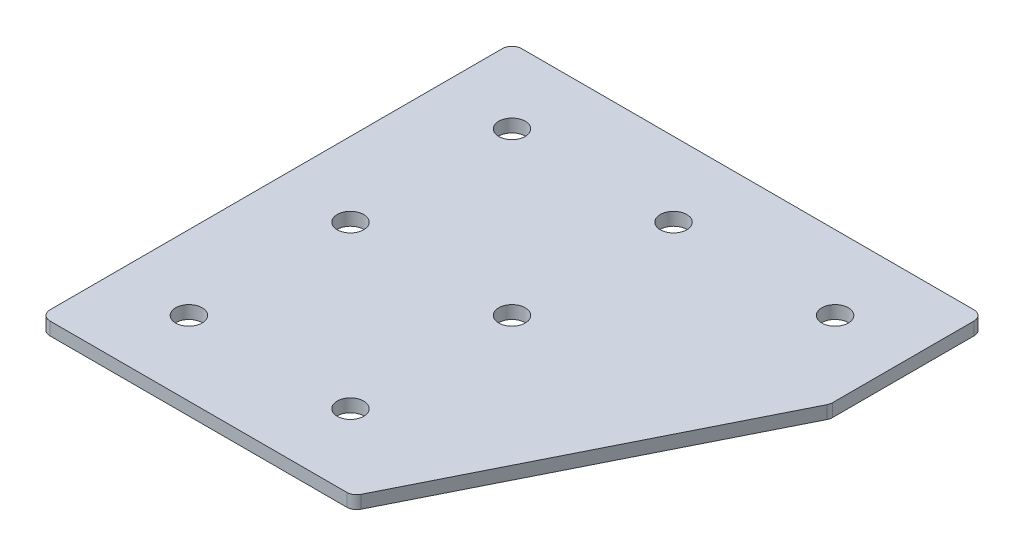
ISO-10303-21;
HEADER;
FILE_DESCRIPTION(('STEP AP214'),'2;1');
FILE_NAME('part.step','',(''),(''),'','','');
FILE_SCHEMA(('AUTOMOTIVE_DESIGN { 1 0 10303 214 1 1 1 1 }'));
ENDSEC;
DATA;
#1=APPLICATION_CONTEXT('core data for automotive mechanical design processes');
#2=APPLICATION_PROTOCOL_DEFINITION('international standard','automotive_design',2000,#1);
#3=PRODUCT_CONTEXT('',#1,'mechanical');
#4=PRODUCT('Part','Part','',(#3));
#5=PRODUCT_RELATED_PRODUCT_CATEGORY('part','',(#4));
#6=PRODUCT_DEFINITION_FORMATION('','',#4);
#7=PRODUCT_DEFINITION_CONTEXT('part definition',#1,'design');
#8=PRODUCT_DEFINITION('design','',#6,#7);
#9=PRODUCT_DEFINITION_SHAPE('','',#8);
#10=(LENGTH_UNIT() NAMED_UNIT(*) SI_UNIT(.MILLI.,.METRE.));
#11=(NAMED_UNIT(*) PLANE_ANGLE_UNIT() SI_UNIT($,.RADIAN.));
#12=(NAMED_UNIT(*) SI_UNIT($,.STERADIAN.) SOLID_ANGLE_UNIT());
#13=UNCERTAINTY_MEASURE_WITH_UNIT(LENGTH_MEASURE(1.E-05),#10,'distance_accuracy_value','');
#14=(GEOMETRIC_REPRESENTATION_CONTEXT(3) GLOBAL_UNCERTAINTY_ASSIGNED_CONTEXT((#13)) GLOBAL_UNIT_ASSIGNED_CONTEXT((#10,
#11,#12)) REPRESENTATION_CONTEXT('',''));
#15=CARTESIAN_POINT('',(0.,0.,0.));
#16=DIRECTION('',(0.,0.,1.));
#17=DIRECTION('',(1.,0.,0.));
#18=AXIS2_PLACEMENT_3D('',#15,#16,#17);
#19=CARTESIAN_POINT('',(-26.9370240083275,0.924626277263087,-50.9871269738255));
#20=DIRECTION('',(0.,-1.,0.));
#21=DIRECTION('',(0.,0.,-1.));
#22=AXIS2_PLACEMENT_3D('',#19,#20,#21);
#23=PLANE('',#22);
#24=CARTESIAN_POINT('',(-1.93702400832748,0.924626277263087,49.0128730261745));
#25=DIRECTION('',(0.,1.,0.));
#26=DIRECTION('',(0.,0.,1.));
#27=AXIS2_PLACEMENT_3D('',#24,#25,#26);
#28=CIRCLE('',#27,4.10000000000001);
#29=CARTESIAN_POINT('',(-1.93702400832748,0.924626277263087,53.1128730261745));
#30=VERTEX_POINT('',#29);
#31=EDGE_CURVE('E255',#30,#30,#28,.T.);
#32=ORIENTED_EDGE('',*,*,#31,.T.);
#33=EDGE_LOOP('',(#32));
#34=FACE_BOUND('',#33,.T.);
#35=CARTESIAN_POINT('',(-51.9370240083275,0.924626277263087,49.0128730261745));
#36=DIRECTION('',(0.,1.,0.));
#37=DIRECTION('',(0.,0.,1.));
#38=AXIS2_PLACEMENT_3D('',#35,#36,#37);
#39=CIRCLE('',#38,4.10000000000001);
#40=CARTESIAN_POINT('',(-51.9370240083275,0.924626277263087,53.1128730261745));
#41=VERTEX_POINT('',#40);
#42=EDGE_CURVE('E263',#41,#41,#39,.T.);
#43=ORIENTED_EDGE('',*,*,#42,.T.);
#44=EDGE_LOOP('',(#43));
#45=FACE_BOUND('',#44,.T.);
#46=CARTESIAN_POINT('',(-1.93702400832747,0.924626277263087,-0.987126973825483));
#47=DIRECTION('',(0.,1.,0.));
#48=DIRECTION('',(0.,0.,1.));
#49=AXIS2_PLACEMENT_3D('',#46,#47,#48);
#50=CIRCLE('',#49,4.1);
#51=CARTESIAN_POINT('',(-1.93702400832747,0.924626277263087,3.11287302617452));
#52=VERTEX_POINT('',#51);
#53=EDGE_CURVE('E269',#52,#52,#50,.T.);
#54=ORIENTED_EDGE('',*,*,#53,.T.);
#55=EDGE_LOOP('',(#54));
#56=FACE_BOUND('',#55,.T.);
#57=CARTESIAN_POINT('',(-51.9370240083275,0.924626277263087,-0.987126973825483));
#58=DIRECTION('',(0.,1.,0.));
#59=DIRECTION('',(0.,0.,1.));
#60=AXIS2_PLACEMENT_3D('',#57,#58,#59);
#61=CIRCLE('',#60,4.1);
#62=CARTESIAN_POINT('',(-51.9370240083275,0.924626277263087,3.11287302617452));
#63=VERTEX_POINT('',#62);
#64=EDGE_CURVE('E275',#63,#63,#61,.T.);
#65=ORIENTED_EDGE('',*,*,#64,.T.);
#66=EDGE_LOOP('',(#65));
#67=FACE_BOUND('',#66,.T.);
#68=CARTESIAN_POINT('',(48.0629759916725,0.924626277263087,-50.9871269738255));
#69=DIRECTION('',(0.,1.,0.));
#70=DIRECTION('',(0.,0.,1.));
#71=AXIS2_PLACEMENT_3D('',#68,#69,#70);
#72=CIRCLE('',#71,4.09999999999999);
#73=CARTESIAN_POINT('',(48.0629759916725,0.924626277263087,-46.8871269738255));
#74=VERTEX_POINT('',#73);
#75=EDGE_CURVE('E281',#74,#74,#72,.T.);
#76=ORIENTED_EDGE('',*,*,#75,.T.);
#77=EDGE_LOOP('',(#76));
#78=FACE_BOUND('',#77,.T.);
#79=CARTESIAN_POINT('',(-1.93702400832746,0.924626277263087,-50.9871269738255));
#80=DIRECTION('',(0.,1.,0.));
#81=DIRECTION('',(0.,0.,1.));
#82=AXIS2_PLACEMENT_3D('',#79,#80,#81);
#83=CIRCLE('',#82,4.1);
#84=CARTESIAN_POINT('',(-1.93702400832746,0.924626277263087,-46.8871269738255));
#85=VERTEX_POINT('',#84);
#86=EDGE_CURVE('E287',#85,#85,#83,.T.);
#87=ORIENTED_EDGE('',*,*,#86,.T.);
#88=EDGE_LOOP('',(#87));
#89=FACE_BOUND('',#88,.T.);
#90=CARTESIAN_POINT('',(-51.9370240083275,0.924626277263087,-50.9871269738255));
#91=DIRECTION('',(0.,1.,0.));
#92=DIRECTION('',(0.,0.,1.));
#93=AXIS2_PLACEMENT_3D('',#90,#91,#92);
#94=CIRCLE('',#93,4.1);
#95=CARTESIAN_POINT('',(-51.9370240083275,0.924626277263087,-46.8871269738255));
#96=VERTEX_POINT('',#95);
#97=EDGE_CURVE('E175',#96,#96,#94,.T.);
#98=ORIENTED_EDGE('',*,*,#97,.T.);
#99=EDGE_LOOP('',(#98));
#100=FACE_BOUND('',#99,.T.);
#101=DIRECTION('',(1.,0.,0.));
#102=VECTOR('',#101,1.);
#103=CARTESIAN_POINT('',(-74.9370240083276,0.924626277263087,72.0128730261745));
#104=LINE('',#103,#102);
#105=CARTESIAN_POINT('',(-71.9370240083276,0.924626277263087,72.0128730261745));
#106=VERTEX_POINT('',#105);
#107=CARTESIAN_POINT('',(19.9728060479232,0.924626277263087,72.0128730261745));
#108=VERTEX_POINT('',#107);
#109=EDGE_CURVE('E121',#106,#108,#104,.T.);
#110=ORIENTED_EDGE('',*,*,#109,.F.);
#111=CARTESIAN_POINT('',(-71.9370240083276,0.924626277263087,69.0128730261745));
#112=DIRECTION('',(0.,-1.,0.));
#113=DIRECTION('',(0.,0.,-1.));
#114=AXIS2_PLACEMENT_3D('',#111,#112,#113);
#115=CIRCLE('',#114,3.);
#116=CARTESIAN_POINT('',(-74.9370240083276,0.924626277263087,69.0128730261745));
#117=VERTEX_POINT('',#116);
#118=EDGE_CURVE('E145',#106,#117,#115,.T.);
#119=ORIENTED_EDGE('',*,*,#118,.T.);
#120=DIRECTION('',(0.,0.,1.));
#121=VECTOR('',#120,1.);
#122=CARTESIAN_POINT('',(-74.9370240083276,0.924626277263087,-73.9871269738255));
#123=LINE('',#122,#121);
#124=CARTESIAN_POINT('',(-74.9370240083276,0.924626277263087,-70.9871269738255));
#125=VERTEX_POINT('',#124);
#126=EDGE_CURVE('E162',#125,#117,#123,.T.);
#127=ORIENTED_EDGE('',*,*,#126,.F.);
#128=CARTESIAN_POINT('',(-71.9370240083276,0.924626277263087,-70.9871269738255));
#129=DIRECTION('',(0.,-1.,0.));
#130=DIRECTION('',(0.,0.,-1.));
#131=AXIS2_PLACEMENT_3D('',#128,#129,#130);
#132=CIRCLE('',#131,3.);
#133=CARTESIAN_POINT('',(-71.9370240083276,0.924626277263087,-73.9871269738255));
#134=VERTEX_POINT('',#133);
#135=EDGE_CURVE('E117',#125,#134,#132,.T.);
#136=ORIENTED_EDGE('',*,*,#135,.T.);
#137=DIRECTION('',(-1.,0.,0.));
#138=VECTOR('',#137,1.);
#139=CARTESIAN_POINT('',(71.0629759916724,0.924626277263087,-73.9871269738255));
#140=LINE('',#139,#138);
#141=CARTESIAN_POINT('',(68.0629759916724,0.924626277263087,-73.9871269738255));
#142=VERTEX_POINT('',#141);
#143=EDGE_CURVE('E160',#142,#134,#140,.T.);
#144=ORIENTED_EDGE('',*,*,#143,.F.);
#145=CARTESIAN_POINT('',(68.0629759916724,0.924626277263087,-70.9871269738255));
#146=DIRECTION('',(0.,-1.,0.));
#147=DIRECTION('',(0.,0.,-1.));
#148=AXIS2_PLACEMENT_3D('',#145,#146,#147);
#149=CIRCLE('',#148,3.);
#150=CARTESIAN_POINT('',(71.0629759916724,0.924626277263087,-70.9871269738255));
#151=VERTEX_POINT('',#150);
#152=EDGE_CURVE('E140',#142,#151,#149,.T.);
#153=ORIENTED_EDGE('',*,*,#152,.T.);
#154=DIRECTION('',(0.,0.,-1.));
#155=VECTOR('',#154,1.);
#156=CARTESIAN_POINT('',(71.0629759916724,0.924626277263087,-26.459262928825));
#157=LINE('',#156,#155);
#158=CARTESIAN_POINT('',(71.0629759916724,0.924626277263087,-27.1674668613244));
#159=VERTEX_POINT('',#158);
#160=EDGE_CURVE('E163',#159,#151,#157,.T.);
#161=ORIENTED_EDGE('',*,*,#160,.F.);
#162=CARTESIAN_POINT('',(68.0629759916724,0.924626277263087,-27.1674668613244));
#163=DIRECTION('',(0.,-1.,0.));
#164=DIRECTION('',(0.,0.,-1.));
#165=AXIS2_PLACEMENT_3D('',#162,#163,#164);
#166=CIRCLE('',#165,3.);
#167=CARTESIAN_POINT('',(70.7462575646721,0.924626277263087,-25.8258260748245));
#168=VERTEX_POINT('',#167);
#169=EDGE_CURVE('E31',#159,#168,#166,.T.);
#170=ORIENTED_EDGE('',*,*,#169,.T.);
#171=DIRECTION('',(0.447213595499956,0.,-0.894427190999917));
#172=VECTOR('',#171,1.);
#173=CARTESIAN_POINT('',(21.8269080141728,0.924626277263087,72.0128730261745));
#174=LINE('',#173,#172);
#175=CARTESIAN_POINT('',(22.6560876209229,0.924626277263087,70.3545138126743));
#176=VERTEX_POINT('',#175);
#177=EDGE_CURVE('E118',#176,#168,#174,.T.);
#178=ORIENTED_EDGE('',*,*,#177,.F.);
#179=CARTESIAN_POINT('',(19.9728060479232,0.924626277263087,69.0128730261745));
#180=DIRECTION('',(0.,-1.,0.));
#181=DIRECTION('',(0.,0.,-1.));
#182=AXIS2_PLACEMENT_3D('',#179,#180,#181);
#183=CIRCLE('',#182,3.);
#184=EDGE_CURVE('E143',#176,#108,#183,.T.);
#185=ORIENTED_EDGE('',*,*,#184,.T.);
#186=EDGE_LOOP('',(#110,#119,#127,#136,#144,#153,#161,#170,#178,#185));
#187=FACE_BOUND('',#186,.T.);
#188=ADVANCED_FACE('F16',(#34,#45,#56,#67,#78,#89,#100,#187),#23,.T.);
#189=CARTESIAN_POINT('',(71.0629759916724,0.924626277263087,-26.459262928825));
#190=DIRECTION('',(1.,0.,0.));
#191=DIRECTION('',(0.,0.,-1.));
#192=AXIS2_PLACEMENT_3D('',#189,#190,#191);
#193=PLANE('',#192);
#194=DIRECTION('',(0.,0.,-1.));
#195=VECTOR('',#194,1.);
#196=CARTESIAN_POINT('',(71.0629759916724,4.92462627726309,-26.459262928825));
#197=LINE('',#196,#195);
#198=CARTESIAN_POINT('',(71.0629759916724,4.92462627726309,-27.1674668613244));
#199=VERTEX_POINT('',#198);
#200=CARTESIAN_POINT('',(71.0629759916724,4.92462627726309,-70.9871269738255));
#201=VERTEX_POINT('',#200);
#202=EDGE_CURVE('E172',#199,#201,#197,.T.);
#203=ORIENTED_EDGE('',*,*,#202,.F.);
#204=DIRECTION('',(0.,1.,0.));
#205=VECTOR('',#204,1.);
#206=CARTESIAN_POINT('',(71.0629759916724,0.924626277263087,-27.1674668613244));
#207=LINE('',#206,#205);
#208=EDGE_CURVE('E154',#199,#159,#207,.F.);
#209=ORIENTED_EDGE('',*,*,#208,.T.);
#210=ORIENTED_EDGE('',*,*,#160,.T.);
#211=DIRECTION('',(0.,1.,0.));
#212=VECTOR('',#211,1.);
#213=CARTESIAN_POINT('',(71.0629759916724,0.924626277263087,-70.9871269738255));
#214=LINE('',#213,#212);
#215=EDGE_CURVE('E151',#151,#201,#214,.T.);
#216=ORIENTED_EDGE('',*,*,#215,.T.);
#217=EDGE_LOOP('',(#203,#209,#210,#216));
#218=FACE_BOUND('',#217,.T.);
#219=ADVANCED_FACE('F206',(#218),#193,.T.);
#220=CARTESIAN_POINT('',(21.8269080141728,0.924626277263087,72.0128730261745));
#221=DIRECTION('',(0.894427190999917,0.,0.447213595499956));
#222=DIRECTION('',(0.447213595499956,0.,-0.894427190999917));
#223=AXIS2_PLACEMENT_3D('',#220,#221,#222);
#224=PLANE('',#223);
#225=DIRECTION('',(0.447213595499956,0.,-0.894427190999917));
#226=VECTOR('',#225,1.);
#227=CARTESIAN_POINT('',(21.8269080141728,4.92462627726309,72.0128730261745));
#228=LINE('',#227,#226);
#229=CARTESIAN_POINT('',(22.6560876209229,4.92462627726309,70.3545138126743));
#230=VERTEX_POINT('',#229);
#231=CARTESIAN_POINT('',(70.7462575646721,4.92462627726309,-25.8258260748245));
#232=VERTEX_POINT('',#231);
#233=EDGE_CURVE('E124',#230,#232,#228,.T.);
#234=ORIENTED_EDGE('',*,*,#233,.F.);
#235=DIRECTION('',(0.,1.,0.));
#236=VECTOR('',#235,1.);
#237=CARTESIAN_POINT('',(22.6560876209229,0.924626277263087,70.3545138126743));
#238=LINE('',#237,#236);
#239=EDGE_CURVE('E38',#230,#176,#238,.F.);
#240=ORIENTED_EDGE('',*,*,#239,.T.);
#241=ORIENTED_EDGE('',*,*,#177,.T.);
#242=DIRECTION('',(0.,1.,0.));
#243=VECTOR('',#242,1.);
#244=CARTESIAN_POINT('',(70.7462575646721,0.924626277263087,-25.8258260748245));
#245=LINE('',#244,#243);
#246=EDGE_CURVE('E147',#168,#232,#245,.T.);
#247=ORIENTED_EDGE('',*,*,#246,.T.);
#248=EDGE_LOOP('',(#234,#240,#241,#247));
#249=FACE_BOUND('',#248,.T.);
#250=ADVANCED_FACE('F180',(#249),#224,.T.);
#251=CARTESIAN_POINT('',(-74.9370240083276,0.924626277263087,72.0128730261745));
#252=DIRECTION('',(0.,0.,1.));
#253=DIRECTION('',(1.,0.,0.));
#254=AXIS2_PLACEMENT_3D('',#251,#252,#253);
#255=PLANE('',#254);
#256=DIRECTION('',(1.,0.,0.));
#257=VECTOR('',#256,1.);
#258=CARTESIAN_POINT('',(-74.9370240083276,4.92462627726309,72.0128730261745));
#259=LINE('',#258,#257);
#260=CARTESIAN_POINT('',(-71.9370240083276,4.92462627726309,72.0128730261745));
#261=VERTEX_POINT('',#260);
#262=CARTESIAN_POINT('',(19.9728060479232,4.92462627726309,72.0128730261745));
#263=VERTEX_POINT('',#262);
#264=EDGE_CURVE('E114',#261,#263,#259,.T.);
#265=ORIENTED_EDGE('',*,*,#264,.F.);
#266=DIRECTION('',(0.,1.,0.));
#267=VECTOR('',#266,1.);
#268=CARTESIAN_POINT('',(-71.9370240083276,0.924626277263087,72.0128730261745));
#269=LINE('',#268,#267);
#270=EDGE_CURVE('E137',#261,#106,#269,.F.);
#271=ORIENTED_EDGE('',*,*,#270,.T.);
#272=ORIENTED_EDGE('',*,*,#109,.T.);
#273=DIRECTION('',(0.,1.,0.));
#274=VECTOR('',#273,1.);
#275=CARTESIAN_POINT('',(19.9728060479232,0.924626277263087,72.0128730261745));
#276=LINE('',#275,#274);
#277=EDGE_CURVE('E134',#108,#263,#276,.T.);
#278=ORIENTED_EDGE('',*,*,#277,.T.);
#279=EDGE_LOOP('',(#265,#271,#272,#278));
#280=FACE_BOUND('',#279,.T.);
#281=ADVANCED_FACE('F189',(#280),#255,.T.);
#282=CARTESIAN_POINT('',(-74.9370240083276,0.924626277263087,-73.9871269738255));
#283=DIRECTION('',(-1.,0.,0.));
#284=DIRECTION('',(0.,0.,1.));
#285=AXIS2_PLACEMENT_3D('',#282,#283,#284);
#286=PLANE('',#285);
#287=ORIENTED_EDGE('',*,*,#126,.T.);
#288=DIRECTION('',(0.,1.,0.));
#289=VECTOR('',#288,1.);
#290=CARTESIAN_POINT('',(-74.9370240083276,0.924626277263087,69.0128730261745));
#291=LINE('',#290,#289);
#292=CARTESIAN_POINT('',(-74.9370240083276,4.92462627726309,69.0128730261745));
#293=VERTEX_POINT('',#292);
#294=EDGE_CURVE('E105',#117,#293,#291,.T.);
#295=ORIENTED_EDGE('',*,*,#294,.T.);
#296=DIRECTION('',(0.,0.,1.));
#297=VECTOR('',#296,1.);
#298=CARTESIAN_POINT('',(-74.9370240083276,4.92462627726309,-73.9871269738255));
#299=LINE('',#298,#297);
#300=CARTESIAN_POINT('',(-74.9370240083276,4.92462627726309,-70.9871269738255));
#301=VERTEX_POINT('',#300);
#302=EDGE_CURVE('E97',#301,#293,#299,.T.);
#303=ORIENTED_EDGE('',*,*,#302,.F.);
#304=DIRECTION('',(0.,1.,0.));
#305=VECTOR('',#304,1.);
#306=CARTESIAN_POINT('',(-74.9370240083276,0.924626277263087,-70.9871269738255));
#307=LINE('',#306,#305);
#308=EDGE_CURVE('E111',#301,#125,#307,.F.);
#309=ORIENTED_EDGE('',*,*,#308,.T.);
#310=EDGE_LOOP('',(#287,#295,#303,#309));
#311=FACE_BOUND('',#310,.T.);
#312=ADVANCED_FACE('F110',(#311),#286,.T.);
#313=CARTESIAN_POINT('',(71.0629759916724,0.924626277263087,-73.9871269738255));
#314=DIRECTION('',(0.,0.,-1.));
#315=DIRECTION('',(-1.,0.,0.));
#316=AXIS2_PLACEMENT_3D('',#313,#314,#315);
#317=PLANE('',#316);
#318=DIRECTION('',(-1.,0.,0.));
#319=VECTOR('',#318,1.);
#320=CARTESIAN_POINT('',(71.0629759916724,4.92462627726309,-73.9871269738255));
#321=LINE('',#320,#319);
#322=CARTESIAN_POINT('',(68.0629759916724,4.92462627726309,-73.9871269738255));
#323=VERTEX_POINT('',#322);
#324=CARTESIAN_POINT('',(-71.9370240083276,4.92462627726309,-73.9871269738255));
#325=VERTEX_POINT('',#324);
#326=EDGE_CURVE('E99',#323,#325,#321,.T.);
#327=ORIENTED_EDGE('',*,*,#326,.F.);
#328=DIRECTION('',(0.,1.,0.));
#329=VECTOR('',#328,1.);
#330=CARTESIAN_POINT('',(68.0629759916724,0.924626277263087,-73.9871269738255));
#331=LINE('',#330,#329);
#332=EDGE_CURVE('E10',#323,#142,#331,.F.);
#333=ORIENTED_EDGE('',*,*,#332,.T.);
#334=ORIENTED_EDGE('',*,*,#143,.T.);
#335=DIRECTION('',(0.,1.,0.));
#336=VECTOR('',#335,1.);
#337=CARTESIAN_POINT('',(-71.9370240083276,0.924626277263087,-73.9871269738255));
#338=LINE('',#337,#336);
#339=EDGE_CURVE('E24',#134,#325,#338,.T.);
#340=ORIENTED_EDGE('',*,*,#339,.T.);
#341=EDGE_LOOP('',(#327,#333,#334,#340));
#342=FACE_BOUND('',#341,.T.);
#343=ADVANCED_FACE('F157',(#342),#317,.T.);
#344=CARTESIAN_POINT('',(-26.9370240083275,4.92462627726309,-50.9871269738255));
#345=DIRECTION('',(0.,-1.,0.));
#346=DIRECTION('',(0.,0.,-1.));
#347=AXIS2_PLACEMENT_3D('',#344,#345,#346);
#348=PLANE('',#347);
#349=CARTESIAN_POINT('',(-1.93702400832748,4.92462627726309,49.0128730261745));
#350=DIRECTION('',(0.,1.,0.));
#351=DIRECTION('',(0.,0.,1.));
#352=AXIS2_PLACEMENT_3D('',#349,#350,#351);
#353=CIRCLE('',#352,4.10000000000001);
#354=CARTESIAN_POINT('',(-1.93702400832748,4.92462627726309,53.1128730261745));
#355=VERTEX_POINT('',#354);
#356=EDGE_CURVE('E258',#355,#355,#353,.T.);
#357=ORIENTED_EDGE('',*,*,#356,.F.);
#358=EDGE_LOOP('',(#357));
#359=FACE_BOUND('',#358,.T.);
#360=CARTESIAN_POINT('',(-51.9370240083275,4.92462627726309,49.0128730261745));
#361=DIRECTION('',(0.,1.,0.));
#362=DIRECTION('',(0.,0.,1.));
#363=AXIS2_PLACEMENT_3D('',#360,#361,#362);
#364=CIRCLE('',#363,4.10000000000001);
#365=CARTESIAN_POINT('',(-51.9370240083275,4.92462627726309,53.1128730261745));
#366=VERTEX_POINT('',#365);
#367=EDGE_CURVE('E260',#366,#366,#364,.T.);
#368=ORIENTED_EDGE('',*,*,#367,.F.);
#369=EDGE_LOOP('',(#368));
#370=FACE_BOUND('',#369,.T.);
#371=CARTESIAN_POINT('',(-1.93702400832747,4.92462627726309,-0.987126973825483));
#372=DIRECTION('',(0.,1.,0.));
#373=DIRECTION('',(0.,0.,1.));
#374=AXIS2_PLACEMENT_3D('',#371,#372,#373);
#375=CIRCLE('',#374,4.1);
#376=CARTESIAN_POINT('',(-1.93702400832747,4.92462627726309,3.11287302617452));
#377=VERTEX_POINT('',#376);
#378=EDGE_CURVE('E266',#377,#377,#375,.T.);
#379=ORIENTED_EDGE('',*,*,#378,.F.);
#380=EDGE_LOOP('',(#379));
#381=FACE_BOUND('',#380,.T.);
#382=CARTESIAN_POINT('',(-51.9370240083275,4.92462627726309,-0.987126973825483));
#383=DIRECTION('',(0.,1.,0.));
#384=DIRECTION('',(0.,0.,1.));
#385=AXIS2_PLACEMENT_3D('',#382,#383,#384);
#386=CIRCLE('',#385,4.1);
#387=CARTESIAN_POINT('',(-51.9370240083275,4.92462627726309,3.11287302617452));
#388=VERTEX_POINT('',#387);
#389=EDGE_CURVE('E272',#388,#388,#386,.T.);
#390=ORIENTED_EDGE('',*,*,#389,.F.);
#391=EDGE_LOOP('',(#390));
#392=FACE_BOUND('',#391,.T.);
#393=CARTESIAN_POINT('',(48.0629759916725,4.92462627726309,-50.9871269738255));
#394=DIRECTION('',(0.,1.,0.));
#395=DIRECTION('',(0.,0.,1.));
#396=AXIS2_PLACEMENT_3D('',#393,#394,#395);
#397=CIRCLE('',#396,4.09999999999999);
#398=CARTESIAN_POINT('',(48.0629759916725,4.92462627726309,-46.8871269738255));
#399=VERTEX_POINT('',#398);
#400=EDGE_CURVE('E278',#399,#399,#397,.T.);
#401=ORIENTED_EDGE('',*,*,#400,.F.);
#402=EDGE_LOOP('',(#401));
#403=FACE_BOUND('',#402,.T.);
#404=CARTESIAN_POINT('',(-1.93702400832746,4.92462627726309,-50.9871269738255));
#405=DIRECTION('',(0.,1.,0.));
#406=DIRECTION('',(0.,0.,1.));
#407=AXIS2_PLACEMENT_3D('',#404,#405,#406);
#408=CIRCLE('',#407,4.1);
#409=CARTESIAN_POINT('',(-1.93702400832746,4.92462627726309,-46.8871269738255));
#410=VERTEX_POINT('',#409);
#411=EDGE_CURVE('E284',#410,#410,#408,.T.);
#412=ORIENTED_EDGE('',*,*,#411,.F.);
#413=EDGE_LOOP('',(#412));
#414=FACE_BOUND('',#413,.T.);
#415=CARTESIAN_POINT('',(-51.9370240083275,4.92462627726309,-50.9871269738255));
#416=DIRECTION('',(0.,1.,0.));
#417=DIRECTION('',(0.,0.,1.));
#418=AXIS2_PLACEMENT_3D('',#415,#416,#417);
#419=CIRCLE('',#418,4.1);
#420=CARTESIAN_POINT('',(-51.9370240083275,4.92462627726309,-46.8871269738255));
#421=VERTEX_POINT('',#420);
#422=EDGE_CURVE('E290',#421,#421,#419,.T.);
#423=ORIENTED_EDGE('',*,*,#422,.F.);
#424=EDGE_LOOP('',(#423));
#425=FACE_BOUND('',#424,.T.);
#426=ORIENTED_EDGE('',*,*,#302,.T.);
#427=CARTESIAN_POINT('',(-71.9370240083276,4.92462627726309,69.0128730261745));
#428=DIRECTION('',(0.,-1.,0.));
#429=DIRECTION('',(0.,0.,-1.));
#430=AXIS2_PLACEMENT_3D('',#427,#428,#429);
#431=CIRCLE('',#430,3.);
#432=EDGE_CURVE('E132',#293,#261,#431,.F.);
#433=ORIENTED_EDGE('',*,*,#432,.T.);
#434=ORIENTED_EDGE('',*,*,#264,.T.);
#435=CARTESIAN_POINT('',(19.9728060479232,4.92462627726309,69.0128730261745));
#436=DIRECTION('',(0.,-1.,0.));
#437=DIRECTION('',(0.,0.,-1.));
#438=AXIS2_PLACEMENT_3D('',#435,#436,#437);
#439=CIRCLE('',#438,3.);
#440=EDGE_CURVE('E130',#263,#230,#439,.F.);
#441=ORIENTED_EDGE('',*,*,#440,.T.);
#442=ORIENTED_EDGE('',*,*,#233,.T.);
#443=CARTESIAN_POINT('',(68.0629759916724,4.92462627726309,-27.1674668613244));
#444=DIRECTION('',(0.,-1.,0.));
#445=DIRECTION('',(0.,0.,-1.));
#446=AXIS2_PLACEMENT_3D('',#443,#444,#445);
#447=CIRCLE('',#446,3.);
#448=EDGE_CURVE('E128',#232,#199,#447,.F.);
#449=ORIENTED_EDGE('',*,*,#448,.T.);
#450=ORIENTED_EDGE('',*,*,#202,.T.);
#451=CARTESIAN_POINT('',(68.0629759916724,4.92462627726309,-70.9871269738255));
#452=DIRECTION('',(0.,-1.,0.));
#453=DIRECTION('',(0.,0.,-1.));
#454=AXIS2_PLACEMENT_3D('',#451,#452,#453);
#455=CIRCLE('',#454,3.);
#456=EDGE_CURVE('E104',#201,#323,#455,.F.);
#457=ORIENTED_EDGE('',*,*,#456,.T.);
#458=ORIENTED_EDGE('',*,*,#326,.T.);
#459=CARTESIAN_POINT('',(-71.9370240083276,4.92462627726309,-70.9871269738255));
#460=DIRECTION('',(0.,-1.,0.));
#461=DIRECTION('',(0.,0.,-1.));
#462=AXIS2_PLACEMENT_3D('',#459,#460,#461);
#463=CIRCLE('',#462,3.);
#464=EDGE_CURVE('E94',#325,#301,#463,.F.);
#465=ORIENTED_EDGE('',*,*,#464,.T.);
#466=EDGE_LOOP('',(#426,#433,#434,#441,#442,#449,#450,#457,#458,#465));
#467=FACE_BOUND('',#466,.T.);
#468=ADVANCED_FACE('F96',(#359,#370,#381,#392,#403,#414,#425,#467),#348,.F.);
#469=CARTESIAN_POINT('',(-71.9370240083276,0.924626277263087,69.0128730261745));
#470=DIRECTION('',(0.,1.,0.));
#471=DIRECTION('',(0.,0.,1.));
#472=AXIS2_PLACEMENT_3D('',#469,#470,#471);
#473=CYLINDRICAL_SURFACE('',#472,3.);
#474=ORIENTED_EDGE('',*,*,#118,.F.);
#475=ORIENTED_EDGE('',*,*,#270,.F.);
#476=ORIENTED_EDGE('',*,*,#432,.F.);
#477=ORIENTED_EDGE('',*,*,#294,.F.);
#478=EDGE_LOOP('',(#474,#475,#476,#477));
#479=FACE_BOUND('',#478,.T.);
#480=ADVANCED_FACE('F192',(#479),#473,.T.);
#481=CARTESIAN_POINT('',(19.9728060479232,0.924626277263087,69.0128730261745));
#482=DIRECTION('',(0.,1.,0.));
#483=DIRECTION('',(0.,0.,1.));
#484=AXIS2_PLACEMENT_3D('',#481,#482,#483);
#485=CYLINDRICAL_SURFACE('',#484,3.);
#486=ORIENTED_EDGE('',*,*,#184,.F.);
#487=ORIENTED_EDGE('',*,*,#239,.F.);
#488=ORIENTED_EDGE('',*,*,#440,.F.);
#489=ORIENTED_EDGE('',*,*,#277,.F.);
#490=EDGE_LOOP('',(#486,#487,#488,#489));
#491=FACE_BOUND('',#490,.T.);
#492=ADVANCED_FACE('F184',(#491),#485,.T.);
#493=CARTESIAN_POINT('',(68.0629759916724,0.924626277263087,-27.1674668613244));
#494=DIRECTION('',(0.,1.,0.));
#495=DIRECTION('',(0.,0.,1.));
#496=AXIS2_PLACEMENT_3D('',#493,#494,#495);
#497=CYLINDRICAL_SURFACE('',#496,3.);
#498=ORIENTED_EDGE('',*,*,#169,.F.);
#499=ORIENTED_EDGE('',*,*,#208,.F.);
#500=ORIENTED_EDGE('',*,*,#448,.F.);
#501=ORIENTED_EDGE('',*,*,#246,.F.);
#502=EDGE_LOOP('',(#498,#499,#500,#501));
#503=FACE_BOUND('',#502,.T.);
#504=ADVANCED_FACE('F200',(#503),#497,.T.);
#505=CARTESIAN_POINT('',(68.0629759916724,0.924626277263087,-70.9871269738255));
#506=DIRECTION('',(0.,1.,0.));
#507=DIRECTION('',(0.,0.,1.));
#508=AXIS2_PLACEMENT_3D('',#505,#506,#507);
#509=CYLINDRICAL_SURFACE('',#508,3.);
#510=ORIENTED_EDGE('',*,*,#152,.F.);
#511=ORIENTED_EDGE('',*,*,#332,.F.);
#512=ORIENTED_EDGE('',*,*,#456,.F.);
#513=ORIENTED_EDGE('',*,*,#215,.F.);
#514=EDGE_LOOP('',(#510,#511,#512,#513));
#515=FACE_BOUND('',#514,.T.);
#516=ADVANCED_FACE('F356',(#515),#509,.T.);
#517=CARTESIAN_POINT('',(-71.9370240083276,0.924626277263087,-70.9871269738255));
#518=DIRECTION('',(0.,1.,0.));
#519=DIRECTION('',(0.,0.,1.));
#520=AXIS2_PLACEMENT_3D('',#517,#518,#519);
#521=CYLINDRICAL_SURFACE('',#520,3.);
#522=ORIENTED_EDGE('',*,*,#135,.F.);
#523=ORIENTED_EDGE('',*,*,#308,.F.);
#524=ORIENTED_EDGE('',*,*,#464,.F.);
#525=ORIENTED_EDGE('',*,*,#339,.F.);
#526=EDGE_LOOP('',(#522,#523,#524,#525));
#527=FACE_BOUND('',#526,.T.);
#528=ADVANCED_FACE('F18',(#527),#521,.T.);
#529=CARTESIAN_POINT('',(-51.9370240083275,0.924626277263087,-50.9871269738255));
#530=DIRECTION('',(0.,1.,0.));
#531=DIRECTION('',(0.,0.,1.));
#532=AXIS2_PLACEMENT_3D('',#529,#530,#531);
#533=CYLINDRICAL_SURFACE('',#532,4.1);
#534=ORIENTED_EDGE('',*,*,#97,.F.);
#535=EDGE_LOOP('',(#534));
#536=FACE_BOUND('',#535,.T.);
#537=ORIENTED_EDGE('',*,*,#422,.T.);
#538=EDGE_LOOP('',(#537));
#539=FACE_BOUND('',#538,.T.);
#540=ADVANCED_FACE('F224',(#536,#539),#533,.F.);
#541=CARTESIAN_POINT('',(-1.93702400832746,0.924626277263087,-50.9871269738255));
#542=DIRECTION('',(0.,1.,0.));
#543=DIRECTION('',(0.,0.,1.));
#544=AXIS2_PLACEMENT_3D('',#541,#542,#543);
#545=CYLINDRICAL_SURFACE('',#544,4.1);
#546=ORIENTED_EDGE('',*,*,#86,.F.);
#547=EDGE_LOOP('',(#546));
#548=FACE_BOUND('',#547,.T.);
#549=ORIENTED_EDGE('',*,*,#411,.T.);
#550=EDGE_LOOP('',(#549));
#551=FACE_BOUND('',#550,.T.);
#552=ADVANCED_FACE('F227',(#548,#551),#545,.F.);
#553=CARTESIAN_POINT('',(48.0629759916725,0.924626277263087,-50.9871269738255));
#554=DIRECTION('',(0.,1.,0.));
#555=DIRECTION('',(0.,0.,1.));
#556=AXIS2_PLACEMENT_3D('',#553,#554,#555);
#557=CYLINDRICAL_SURFACE('',#556,4.09999999999999);
#558=ORIENTED_EDGE('',*,*,#75,.F.);
#559=EDGE_LOOP('',(#558));
#560=FACE_BOUND('',#559,.T.);
#561=ORIENTED_EDGE('',*,*,#400,.T.);
#562=EDGE_LOOP('',(#561));
#563=FACE_BOUND('',#562,.T.);
#564=ADVANCED_FACE('F231',(#560,#563),#557,.F.);
#565=CARTESIAN_POINT('',(-51.9370240083275,0.924626277263087,-0.987126973825483));
#566=DIRECTION('',(0.,1.,0.));
#567=DIRECTION('',(0.,0.,1.));
#568=AXIS2_PLACEMENT_3D('',#565,#566,#567);
#569=CYLINDRICAL_SURFACE('',#568,4.1);
#570=ORIENTED_EDGE('',*,*,#64,.F.);
#571=EDGE_LOOP('',(#570));
#572=FACE_BOUND('',#571,.T.);
#573=ORIENTED_EDGE('',*,*,#389,.T.);
#574=EDGE_LOOP('',(#573));
#575=FACE_BOUND('',#574,.T.);
#576=ADVANCED_FACE('F235',(#572,#575),#569,.F.);
#577=CARTESIAN_POINT('',(-1.93702400832747,0.924626277263087,-0.987126973825483));
#578=DIRECTION('',(0.,1.,0.));
#579=DIRECTION('',(0.,0.,1.));
#580=AXIS2_PLACEMENT_3D('',#577,#578,#579);
#581=CYLINDRICAL_SURFACE('',#580,4.1);
#582=ORIENTED_EDGE('',*,*,#53,.F.);
#583=EDGE_LOOP('',(#582));
#584=FACE_BOUND('',#583,.T.);
#585=ORIENTED_EDGE('',*,*,#378,.T.);
#586=EDGE_LOOP('',(#585));
#587=FACE_BOUND('',#586,.T.);
#588=ADVANCED_FACE('F239',(#584,#587),#581,.F.);
#589=CARTESIAN_POINT('',(-51.9370240083275,0.924626277263087,49.0128730261745));
#590=DIRECTION('',(0.,1.,0.));
#591=DIRECTION('',(0.,0.,1.));
#592=AXIS2_PLACEMENT_3D('',#589,#590,#591);
#593=CYLINDRICAL_SURFACE('',#592,4.10000000000001);
#594=ORIENTED_EDGE('',*,*,#42,.F.);
#595=EDGE_LOOP('',(#594));
#596=FACE_BOUND('',#595,.T.);
#597=ORIENTED_EDGE('',*,*,#367,.T.);
#598=EDGE_LOOP('',(#597));
#599=FACE_BOUND('',#598,.T.);
#600=ADVANCED_FACE('F243',(#596,#599),#593,.F.);
#601=CARTESIAN_POINT('',(-1.93702400832748,0.924626277263087,49.0128730261745));
#602=DIRECTION('',(0.,1.,0.));
#603=DIRECTION('',(0.,0.,1.));
#604=AXIS2_PLACEMENT_3D('',#601,#602,#603);
#605=CYLINDRICAL_SURFACE('',#604,4.10000000000001);
#606=ORIENTED_EDGE('',*,*,#31,.F.);
#607=EDGE_LOOP('',(#606));
#608=FACE_BOUND('',#607,.T.);
#609=ORIENTED_EDGE('',*,*,#356,.T.);
#610=EDGE_LOOP('',(#609));
#611=FACE_BOUND('',#610,.T.);
#612=ADVANCED_FACE('F247',(#608,#611),#605,.F.);
#613=CLOSED_SHELL('',(#188,#219,#250,#281,#312,#343,#468,#480,#492,#504,#516,#528,#540,#552,
#564,#576,#588,#600,#612));
#614=MANIFOLD_SOLID_BREP('B1',#613);
#615=ADVANCED_BREP_SHAPE_REPRESENTATION('',(#18,#614),#14);
#616=SHAPE_DEFINITION_REPRESENTATION(#9,#615);
ENDSEC;
END-ISO-10303-21;
